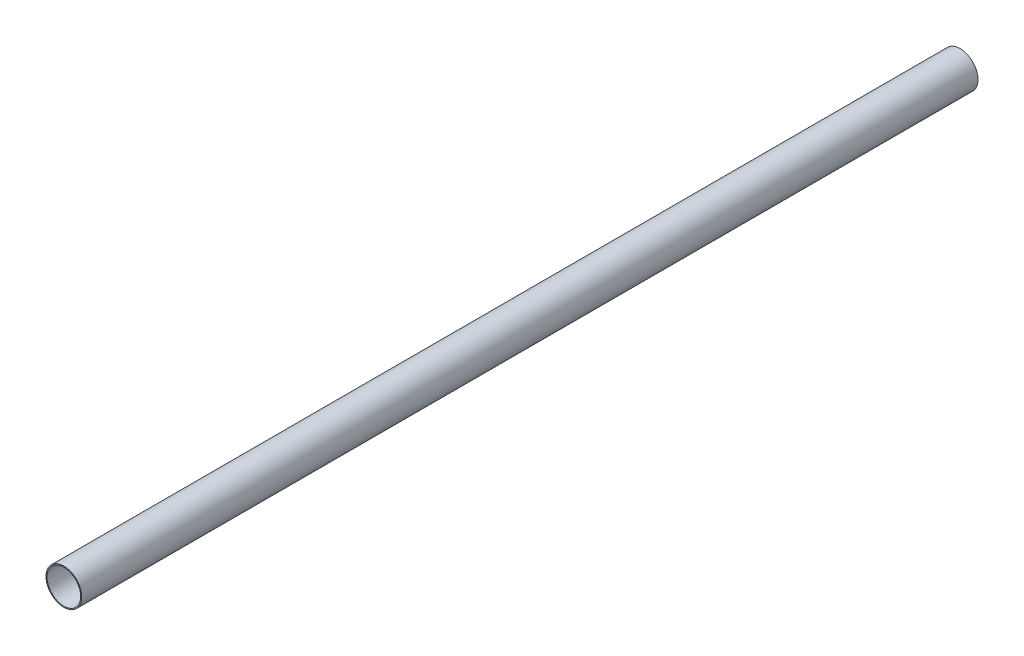
ISO-10303-21;
HEADER;
FILE_DESCRIPTION(('STEP AP214'),'2;1');
FILE_NAME('part.step','',(''),(''),'','','');
FILE_SCHEMA(('AUTOMOTIVE_DESIGN { 1 0 10303 214 1 1 1 1 }'));
ENDSEC;
DATA;
#1=APPLICATION_CONTEXT('core data for automotive mechanical design processes');
#2=APPLICATION_PROTOCOL_DEFINITION('international standard','automotive_design',2000,#1);
#3=PRODUCT_CONTEXT('',#1,'mechanical');
#4=PRODUCT('Part','Part','',(#3));
#5=PRODUCT_RELATED_PRODUCT_CATEGORY('part','',(#4));
#6=PRODUCT_DEFINITION_FORMATION('','',#4);
#7=PRODUCT_DEFINITION_CONTEXT('part definition',#1,'design');
#8=PRODUCT_DEFINITION('design','',#6,#7);
#9=PRODUCT_DEFINITION_SHAPE('','',#8);
#10=(LENGTH_UNIT() NAMED_UNIT(*) SI_UNIT(.MILLI.,.METRE.));
#11=(NAMED_UNIT(*) PLANE_ANGLE_UNIT() SI_UNIT($,.RADIAN.));
#12=(NAMED_UNIT(*) SI_UNIT($,.STERADIAN.) SOLID_ANGLE_UNIT());
#13=UNCERTAINTY_MEASURE_WITH_UNIT(LENGTH_MEASURE(1.E-05),#10,'distance_accuracy_value','');
#14=(GEOMETRIC_REPRESENTATION_CONTEXT(3) GLOBAL_UNCERTAINTY_ASSIGNED_CONTEXT((#13)) GLOBAL_UNIT_ASSIGNED_CONTEXT((#10,
#11,#12)) REPRESENTATION_CONTEXT('',''));
#15=CARTESIAN_POINT('',(0.,0.,0.));
#16=DIRECTION('',(0.,0.,1.));
#17=DIRECTION('',(1.,0.,0.));
#18=AXIS2_PLACEMENT_3D('',#15,#16,#17);
#19=CARTESIAN_POINT('',(0.,0.,5486.4));
#20=DIRECTION('',(0.,0.,1.));
#21=DIRECTION('',(1.,0.,0.));
#22=AXIS2_PLACEMENT_3D('',#19,#20,#21);
#23=PLANE('',#22);
#24=CARTESIAN_POINT('',(0.,0.,5486.4));
#25=DIRECTION('',(0.,0.,1.));
#26=DIRECTION('',(1.,0.,0.));
#27=AXIS2_PLACEMENT_3D('',#24,#25,#26);
#28=CIRCLE('',#27,109.474);
#29=CARTESIAN_POINT('',(109.474,0.,5486.4));
#30=VERTEX_POINT('',#29);
#31=EDGE_CURVE('E10',#30,#30,#28,.T.);
#32=ORIENTED_EDGE('',*,*,#31,.T.);
#33=EDGE_LOOP('',(#32));
#34=FACE_BOUND('',#33,.T.);
#35=CARTESIAN_POINT('',(0.,0.,5486.4));
#36=DIRECTION('',(0.,0.,1.));
#37=DIRECTION('',(1.,0.,0.));
#38=AXIS2_PLACEMENT_3D('',#35,#36,#37);
#39=CIRCLE('',#38,103.124);
#40=CARTESIAN_POINT('',(103.124,0.,5486.4));
#41=VERTEX_POINT('',#40);
#42=EDGE_CURVE('E39',#41,#41,#39,.T.);
#43=ORIENTED_EDGE('',*,*,#42,.F.);
#44=EDGE_LOOP('',(#43));
#45=FACE_BOUND('',#44,.T.);
#46=ADVANCED_FACE('F28',(#34,#45),#23,.T.);
#47=CARTESIAN_POINT('',(0.,0.,0.));
#48=DIRECTION('',(0.,0.,1.));
#49=DIRECTION('',(1.,0.,0.));
#50=AXIS2_PLACEMENT_3D('',#47,#48,#49);
#51=PLANE('',#50);
#52=CARTESIAN_POINT('',(0.,0.,0.));
#53=DIRECTION('',(0.,0.,1.));
#54=DIRECTION('',(1.,0.,0.));
#55=AXIS2_PLACEMENT_3D('',#52,#53,#54);
#56=CIRCLE('',#55,109.474);
#57=CARTESIAN_POINT('',(109.474,0.,0.));
#58=VERTEX_POINT('',#57);
#59=EDGE_CURVE('E32',#58,#58,#56,.T.);
#60=ORIENTED_EDGE('',*,*,#59,.F.);
#61=EDGE_LOOP('',(#60));
#62=FACE_BOUND('',#61,.T.);
#63=CARTESIAN_POINT('',(0.,0.,0.));
#64=DIRECTION('',(0.,0.,1.));
#65=DIRECTION('',(1.,0.,0.));
#66=AXIS2_PLACEMENT_3D('',#63,#64,#65);
#67=CIRCLE('',#66,103.124);
#68=CARTESIAN_POINT('',(103.124,0.,0.));
#69=VERTEX_POINT('',#68);
#70=EDGE_CURVE('E41',#69,#69,#67,.T.);
#71=ORIENTED_EDGE('',*,*,#70,.T.);
#72=EDGE_LOOP('',(#71));
#73=FACE_BOUND('',#72,.T.);
#74=ADVANCED_FACE('F51',(#62,#73),#51,.F.);
#75=CARTESIAN_POINT('',(0.,0.,5486.4));
#76=DIRECTION('',(0.,0.,-1.));
#77=DIRECTION('',(-1.,0.,0.));
#78=AXIS2_PLACEMENT_3D('',#75,#76,#77);
#79=CYLINDRICAL_SURFACE('',#78,109.474);
#80=ORIENTED_EDGE('',*,*,#31,.F.);
#81=EDGE_LOOP('',(#80));
#82=FACE_BOUND('',#81,.T.);
#83=ORIENTED_EDGE('',*,*,#59,.T.);
#84=EDGE_LOOP('',(#83));
#85=FACE_BOUND('',#84,.T.);
#86=ADVANCED_FACE('F30',(#82,#85),#79,.T.);
#87=CARTESIAN_POINT('',(0.,0.,5486.4));
#88=DIRECTION('',(0.,0.,-1.));
#89=DIRECTION('',(-1.,0.,0.));
#90=AXIS2_PLACEMENT_3D('',#87,#88,#89);
#91=CYLINDRICAL_SURFACE('',#90,103.124);
#92=ORIENTED_EDGE('',*,*,#42,.T.);
#93=EDGE_LOOP('',(#92));
#94=FACE_BOUND('',#93,.T.);
#95=ORIENTED_EDGE('',*,*,#70,.F.);
#96=EDGE_LOOP('',(#95));
#97=FACE_BOUND('',#96,.T.);
#98=ADVANCED_FACE('F47',(#94,#97),#91,.F.);
#99=CLOSED_SHELL('',(#46,#74,#86,#98));
#100=MANIFOLD_SOLID_BREP('B2',#99);
#101=ADVANCED_BREP_SHAPE_REPRESENTATION('',(#18,#100),#14);
#102=SHAPE_DEFINITION_REPRESENTATION(#9,#101);
ENDSEC;
END-ISO-10303-21;
